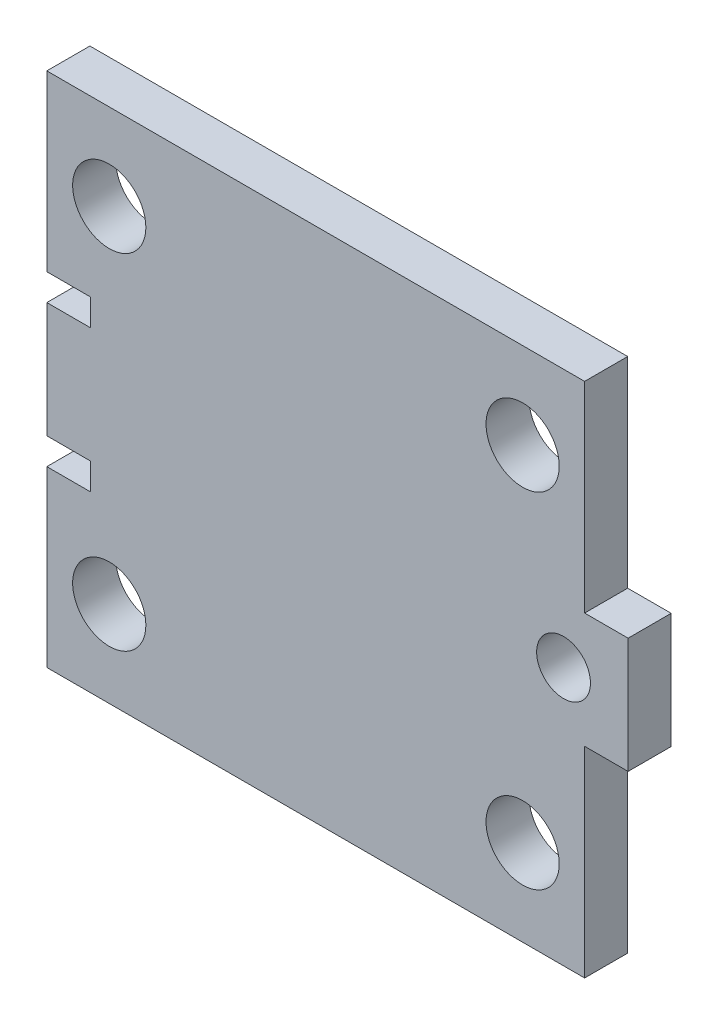
ISO-10303-21;
HEADER;
FILE_DESCRIPTION(('STEP AP214'),'2;1');
FILE_NAME('part.step','',(''),(''),'','','');
FILE_SCHEMA(('AUTOMOTIVE_DESIGN { 1 0 10303 214 1 1 1 1 }'));
ENDSEC;
DATA;
#1=APPLICATION_CONTEXT('core data for automotive mechanical design processes');
#2=APPLICATION_PROTOCOL_DEFINITION('international standard','automotive_design',2000,#1);
#3=PRODUCT_CONTEXT('',#1,'mechanical');
#4=PRODUCT('Part','Part','',(#3));
#5=PRODUCT_RELATED_PRODUCT_CATEGORY('part','',(#4));
#6=PRODUCT_DEFINITION_FORMATION('','',#4);
#7=PRODUCT_DEFINITION_CONTEXT('part definition',#1,'design');
#8=PRODUCT_DEFINITION('design','',#6,#7);
#9=PRODUCT_DEFINITION_SHAPE('','',#8);
#10=(LENGTH_UNIT() NAMED_UNIT(*) SI_UNIT(.MILLI.,.METRE.));
#11=(NAMED_UNIT(*) PLANE_ANGLE_UNIT() SI_UNIT($,.RADIAN.));
#12=(NAMED_UNIT(*) SI_UNIT($,.STERADIAN.) SOLID_ANGLE_UNIT());
#13=UNCERTAINTY_MEASURE_WITH_UNIT(LENGTH_MEASURE(1.E-05),#10,'distance_accuracy_value','');
#14=(GEOMETRIC_REPRESENTATION_CONTEXT(3) GLOBAL_UNCERTAINTY_ASSIGNED_CONTEXT((#13)) GLOBAL_UNIT_ASSIGNED_CONTEXT((#10,
#11,#12)) REPRESENTATION_CONTEXT('',''));
#15=CARTESIAN_POINT('',(0.,0.,0.));
#16=DIRECTION('',(0.,0.,1.));
#17=DIRECTION('',(1.,0.,0.));
#18=AXIS2_PLACEMENT_3D('',#15,#16,#17);
#19=CARTESIAN_POINT('',(-67.5,-60.,-5.));
#20=DIRECTION('',(1.,0.,0.));
#21=DIRECTION('',(0.,1.,0.));
#22=AXIS2_PLACEMENT_3D('',#19,#20,#21);
#23=PLANE('',#22);
#24=DIRECTION('',(0.,0.,-1.));
#25=VECTOR('',#24,1.);
#26=CARTESIAN_POINT('',(-67.5,-13.4,-5.));
#27=LINE('',#26,#25);
#28=CARTESIAN_POINT('',(-67.5,-13.4,5.));
#29=VERTEX_POINT('',#28);
#30=CARTESIAN_POINT('',(-67.5,-13.4,-5.));
#31=VERTEX_POINT('',#30);
#32=EDGE_CURVE('E11',#29,#31,#27,.T.);
#33=ORIENTED_EDGE('',*,*,#32,.F.);
#34=DIRECTION('',(0.,1.,0.));
#35=VECTOR('',#34,1.);
#36=CARTESIAN_POINT('',(-67.5,-60.,5.));
#37=LINE('',#36,#35);
#38=CARTESIAN_POINT('',(-67.5,13.4,5.));
#39=VERTEX_POINT('',#38);
#40=EDGE_CURVE('E132',#29,#39,#37,.T.);
#41=ORIENTED_EDGE('',*,*,#40,.T.);
#42=DIRECTION('',(0.,0.,-1.));
#43=VECTOR('',#42,1.);
#44=CARTESIAN_POINT('',(-67.5,13.4,-5.));
#45=LINE('',#44,#43);
#46=CARTESIAN_POINT('',(-67.5,13.4,-5.));
#47=VERTEX_POINT('',#46);
#48=EDGE_CURVE('E50',#39,#47,#45,.T.);
#49=ORIENTED_EDGE('',*,*,#48,.T.);
#50=DIRECTION('',(0.,1.,0.));
#51=VECTOR('',#50,1.);
#52=CARTESIAN_POINT('',(-67.5,-60.,-5.));
#53=LINE('',#52,#51);
#54=EDGE_CURVE('E256',#31,#47,#53,.T.);
#55=ORIENTED_EDGE('',*,*,#54,.F.);
#56=EDGE_LOOP('',(#33,#41,#49,#55));
#57=FACE_BOUND('',#56,.T.);
#58=ADVANCED_FACE('F39',(#57),#23,.F.);
#59=CARTESIAN_POINT('',(-67.5,13.4,-5.));
#60=DIRECTION('',(0.,-1.,0.));
#61=DIRECTION('',(1.,0.,0.));
#62=AXIS2_PLACEMENT_3D('',#59,#60,#61);
#63=PLANE('',#62);
#64=ORIENTED_EDGE('',*,*,#48,.F.);
#65=DIRECTION('',(1.,0.,0.));
#66=VECTOR('',#65,1.);
#67=CARTESIAN_POINT('',(67.5,13.4,5.));
#68=LINE('',#67,#66);
#69=CARTESIAN_POINT('',(-57.4,13.4,5.));
#70=VERTEX_POINT('',#69);
#71=EDGE_CURVE('E194',#39,#70,#68,.T.);
#72=ORIENTED_EDGE('',*,*,#71,.T.);
#73=DIRECTION('',(0.,0.,-1.));
#74=VECTOR('',#73,1.);
#75=CARTESIAN_POINT('',(-57.4,13.4,-5.));
#76=LINE('',#75,#74);
#77=CARTESIAN_POINT('',(-57.4,13.4,-5.));
#78=VERTEX_POINT('',#77);
#79=EDGE_CURVE('E245',#70,#78,#76,.T.);
#80=ORIENTED_EDGE('',*,*,#79,.T.);
#81=DIRECTION('',(1.,0.,0.));
#82=VECTOR('',#81,1.);
#83=CARTESIAN_POINT('',(-67.5,13.4,-5.));
#84=LINE('',#83,#82);
#85=EDGE_CURVE('E265',#47,#78,#84,.T.);
#86=ORIENTED_EDGE('',*,*,#85,.F.);
#87=EDGE_LOOP('',(#64,#72,#80,#86));
#88=FACE_BOUND('',#87,.T.);
#89=ADVANCED_FACE('F270',(#88),#63,.F.);
#90=CARTESIAN_POINT('',(-57.4,19.6,-5.));
#91=DIRECTION('',(1.,0.,0.));
#92=DIRECTION('',(0.,1.,0.));
#93=AXIS2_PLACEMENT_3D('',#90,#91,#92);
#94=PLANE('',#93);
#95=ORIENTED_EDGE('',*,*,#79,.F.);
#96=DIRECTION('',(0.,1.,0.));
#97=VECTOR('',#96,1.);
#98=CARTESIAN_POINT('',(-57.4,-60.,5.));
#99=LINE('',#98,#97);
#100=CARTESIAN_POINT('',(-57.4,19.6,5.));
#101=VERTEX_POINT('',#100);
#102=EDGE_CURVE('E190',#70,#101,#99,.T.);
#103=ORIENTED_EDGE('',*,*,#102,.T.);
#104=DIRECTION('',(0.,0.,-1.));
#105=VECTOR('',#104,1.);
#106=CARTESIAN_POINT('',(-57.4,19.6,-5.));
#107=LINE('',#106,#105);
#108=CARTESIAN_POINT('',(-57.4,19.6,-5.));
#109=VERTEX_POINT('',#108);
#110=EDGE_CURVE('E241',#101,#109,#107,.T.);
#111=ORIENTED_EDGE('',*,*,#110,.T.);
#112=DIRECTION('',(0.,1.,0.));
#113=VECTOR('',#112,1.);
#114=CARTESIAN_POINT('',(-57.4,19.6,-5.));
#115=LINE('',#114,#113);
#116=EDGE_CURVE('E272',#78,#109,#115,.T.);
#117=ORIENTED_EDGE('',*,*,#116,.F.);
#118=EDGE_LOOP('',(#95,#103,#111,#117));
#119=FACE_BOUND('',#118,.T.);
#120=ADVANCED_FACE('F359',(#119),#94,.F.);
#121=CARTESIAN_POINT('',(-67.5,19.6,-5.));
#122=DIRECTION('',(0.,1.,0.));
#123=DIRECTION('',(-1.,0.,0.));
#124=AXIS2_PLACEMENT_3D('',#121,#122,#123);
#125=PLANE('',#124);
#126=ORIENTED_EDGE('',*,*,#110,.F.);
#127=DIRECTION('',(1.,0.,0.));
#128=VECTOR('',#127,1.);
#129=CARTESIAN_POINT('',(67.5,19.6,5.));
#130=LINE('',#129,#128);
#131=CARTESIAN_POINT('',(-67.5,19.6,5.));
#132=VERTEX_POINT('',#131);
#133=EDGE_CURVE('E186',#101,#132,#130,.F.);
#134=ORIENTED_EDGE('',*,*,#133,.T.);
#135=DIRECTION('',(0.,0.,-1.));
#136=VECTOR('',#135,1.);
#137=CARTESIAN_POINT('',(-67.5,19.6,-5.));
#138=LINE('',#137,#136);
#139=CARTESIAN_POINT('',(-67.5,19.6,-5.));
#140=VERTEX_POINT('',#139);
#141=EDGE_CURVE('E237',#132,#140,#138,.T.);
#142=ORIENTED_EDGE('',*,*,#141,.T.);
#143=DIRECTION('',(-1.,0.,0.));
#144=VECTOR('',#143,1.);
#145=CARTESIAN_POINT('',(-67.5,19.6,-5.));
#146=LINE('',#145,#144);
#147=EDGE_CURVE('E276',#109,#140,#146,.T.);
#148=ORIENTED_EDGE('',*,*,#147,.F.);
#149=EDGE_LOOP('',(#126,#134,#142,#148));
#150=FACE_BOUND('',#149,.T.);
#151=ADVANCED_FACE('F364',(#150),#125,.F.);
#152=ORIENTED_EDGE('',*,*,#141,.F.);
#153=DIRECTION('',(0.,1.,0.));
#154=VECTOR('',#153,1.);
#155=CARTESIAN_POINT('',(-67.5,-60.,5.));
#156=LINE('',#155,#154);
#157=CARTESIAN_POINT('',(-67.5,60.,5.));
#158=VERTEX_POINT('',#157);
#159=EDGE_CURVE('E182',#132,#158,#156,.T.);
#160=ORIENTED_EDGE('',*,*,#159,.T.);
#161=DIRECTION('',(0.,0.,-1.));
#162=VECTOR('',#161,1.);
#163=CARTESIAN_POINT('',(-67.5,60.,-5.));
#164=LINE('',#163,#162);
#165=CARTESIAN_POINT('',(-67.5,60.,-5.));
#166=VERTEX_POINT('',#165);
#167=EDGE_CURVE('E233',#158,#166,#164,.T.);
#168=ORIENTED_EDGE('',*,*,#167,.T.);
#169=EDGE_CURVE('E269',#140,#166,#53,.T.);
#170=ORIENTED_EDGE('',*,*,#169,.F.);
#171=EDGE_LOOP('',(#152,#160,#168,#170));
#172=FACE_BOUND('',#171,.T.);
#173=ADVANCED_FACE('F354',(#172),#23,.F.);
#174=CARTESIAN_POINT('',(67.5,60.,-5.));
#175=DIRECTION('',(0.,1.,0.));
#176=DIRECTION('',(-1.,0.,0.));
#177=AXIS2_PLACEMENT_3D('',#174,#175,#176);
#178=PLANE('',#177);
#179=ORIENTED_EDGE('',*,*,#167,.F.);
#180=DIRECTION('',(1.,0.,0.));
#181=VECTOR('',#180,1.);
#182=CARTESIAN_POINT('',(67.5,60.,5.));
#183=LINE('',#182,#181);
#184=CARTESIAN_POINT('',(57.4,60.,5.));
#185=VERTEX_POINT('',#184);
#186=EDGE_CURVE('E178',#185,#158,#183,.F.);
#187=ORIENTED_EDGE('',*,*,#186,.F.);
#188=DIRECTION('',(0.,0.,-1.));
#189=VECTOR('',#188,1.);
#190=CARTESIAN_POINT('',(57.4,60.,-5.));
#191=LINE('',#190,#189);
#192=CARTESIAN_POINT('',(57.4,60.,-5.));
#193=VERTEX_POINT('',#192);
#194=EDGE_CURVE('E229',#185,#193,#191,.T.);
#195=ORIENTED_EDGE('',*,*,#194,.T.);
#196=DIRECTION('',(-1.,0.,0.));
#197=VECTOR('',#196,1.);
#198=CARTESIAN_POINT('',(67.5,60.,-5.));
#199=LINE('',#198,#197);
#200=EDGE_CURVE('E283',#193,#166,#199,.T.);
#201=ORIENTED_EDGE('',*,*,#200,.T.);
#202=EDGE_LOOP('',(#179,#187,#195,#201));
#203=FACE_BOUND('',#202,.T.);
#204=ADVANCED_FACE('F363',(#203),#178,.T.);
#205=CARTESIAN_POINT('',(57.4,19.6,-5.));
#206=DIRECTION('',(-1.,0.,0.));
#207=DIRECTION('',(0.,-1.,0.));
#208=AXIS2_PLACEMENT_3D('',#205,#206,#207);
#209=PLANE('',#208);
#210=ORIENTED_EDGE('',*,*,#194,.F.);
#211=DIRECTION('',(0.,1.,0.));
#212=VECTOR('',#211,1.);
#213=CARTESIAN_POINT('',(57.4,-60.,5.));
#214=LINE('',#213,#212);
#215=CARTESIAN_POINT('',(57.4,13.4,5.));
#216=VERTEX_POINT('',#215);
#217=EDGE_CURVE('E174',#185,#216,#214,.F.);
#218=ORIENTED_EDGE('',*,*,#217,.T.);
#219=DIRECTION('',(0.,0.,-1.));
#220=VECTOR('',#219,1.);
#221=CARTESIAN_POINT('',(57.4,13.4,-5.));
#222=LINE('',#221,#220);
#223=CARTESIAN_POINT('',(57.4,13.4,-5.));
#224=VERTEX_POINT('',#223);
#225=EDGE_CURVE('E225',#216,#224,#222,.T.);
#226=ORIENTED_EDGE('',*,*,#225,.T.);
#227=DIRECTION('',(0.,-1.,0.));
#228=VECTOR('',#227,1.);
#229=CARTESIAN_POINT('',(57.4,19.6,-5.));
#230=LINE('',#229,#228);
#231=EDGE_CURVE('E287',#193,#224,#230,.T.);
#232=ORIENTED_EDGE('',*,*,#231,.F.);
#233=EDGE_LOOP('',(#210,#218,#226,#232));
#234=FACE_BOUND('',#233,.T.);
#235=ADVANCED_FACE('F656',(#234),#209,.F.);
#236=CARTESIAN_POINT('',(67.5,13.4,-5.));
#237=DIRECTION('',(0.,-1.,0.));
#238=DIRECTION('',(1.,0.,0.));
#239=AXIS2_PLACEMENT_3D('',#236,#237,#238);
#240=PLANE('',#239);
#241=ORIENTED_EDGE('',*,*,#225,.F.);
#242=DIRECTION('',(1.,0.,0.));
#243=VECTOR('',#242,1.);
#244=CARTESIAN_POINT('',(67.5,13.4,5.));
#245=LINE('',#244,#243);
#246=CARTESIAN_POINT('',(67.5,13.4,5.));
#247=VERTEX_POINT('',#246);
#248=EDGE_CURVE('E170',#216,#247,#245,.T.);
#249=ORIENTED_EDGE('',*,*,#248,.T.);
#250=DIRECTION('',(0.,0.,-1.));
#251=VECTOR('',#250,1.);
#252=CARTESIAN_POINT('',(67.5,13.4,-5.));
#253=LINE('',#252,#251);
#254=CARTESIAN_POINT('',(67.5,13.4,-5.));
#255=VERTEX_POINT('',#254);
#256=EDGE_CURVE('E221',#247,#255,#253,.T.);
#257=ORIENTED_EDGE('',*,*,#256,.T.);
#258=DIRECTION('',(1.,0.,0.));
#259=VECTOR('',#258,1.);
#260=CARTESIAN_POINT('',(67.5,13.4,-5.));
#261=LINE('',#260,#259);
#262=EDGE_CURVE('E291',#224,#255,#261,.T.);
#263=ORIENTED_EDGE('',*,*,#262,.F.);
#264=EDGE_LOOP('',(#241,#249,#257,#263));
#265=FACE_BOUND('',#264,.T.);
#266=ADVANCED_FACE('F644',(#265),#240,.F.);
#267=CARTESIAN_POINT('',(67.5,-60.,-5.));
#268=DIRECTION('',(1.,0.,0.));
#269=DIRECTION('',(0.,1.,0.));
#270=AXIS2_PLACEMENT_3D('',#267,#268,#269);
#271=PLANE('',#270);
#272=ORIENTED_EDGE('',*,*,#256,.F.);
#273=DIRECTION('',(0.,1.,0.));
#274=VECTOR('',#273,1.);
#275=CARTESIAN_POINT('',(67.5,-60.,5.));
#276=LINE('',#275,#274);
#277=CARTESIAN_POINT('',(67.5,-13.4,5.));
#278=VERTEX_POINT('',#277);
#279=EDGE_CURVE('E166',#278,#247,#276,.T.);
#280=ORIENTED_EDGE('',*,*,#279,.F.);
#281=DIRECTION('',(0.,0.,-1.));
#282=VECTOR('',#281,1.);
#283=CARTESIAN_POINT('',(67.5,-13.4,-5.));
#284=LINE('',#283,#282);
#285=CARTESIAN_POINT('',(67.5,-13.4,-5.));
#286=VERTEX_POINT('',#285);
#287=EDGE_CURVE('E217',#278,#286,#284,.T.);
#288=ORIENTED_EDGE('',*,*,#287,.T.);
#289=DIRECTION('',(0.,1.,0.));
#290=VECTOR('',#289,1.);
#291=CARTESIAN_POINT('',(67.5,-60.,-5.));
#292=LINE('',#291,#290);
#293=EDGE_CURVE('E295',#286,#255,#292,.T.);
#294=ORIENTED_EDGE('',*,*,#293,.T.);
#295=EDGE_LOOP('',(#272,#280,#288,#294));
#296=FACE_BOUND('',#295,.T.);
#297=ADVANCED_FACE('F632',(#296),#271,.T.);
#298=CARTESIAN_POINT('',(67.5,-13.4,-5.));
#299=DIRECTION('',(0.,1.,0.));
#300=DIRECTION('',(-1.,0.,0.));
#301=AXIS2_PLACEMENT_3D('',#298,#299,#300);
#302=PLANE('',#301);
#303=ORIENTED_EDGE('',*,*,#287,.F.);
#304=DIRECTION('',(1.,0.,0.));
#305=VECTOR('',#304,1.);
#306=CARTESIAN_POINT('',(67.5,-13.4,5.));
#307=LINE('',#306,#305);
#308=CARTESIAN_POINT('',(57.4,-13.4,5.));
#309=VERTEX_POINT('',#308);
#310=EDGE_CURVE('E162',#278,#309,#307,.F.);
#311=ORIENTED_EDGE('',*,*,#310,.T.);
#312=DIRECTION('',(0.,0.,-1.));
#313=VECTOR('',#312,1.);
#314=CARTESIAN_POINT('',(57.4,-13.4,-5.));
#315=LINE('',#314,#313);
#316=CARTESIAN_POINT('',(57.4,-13.4,-5.));
#317=VERTEX_POINT('',#316);
#318=EDGE_CURVE('E213',#309,#317,#315,.T.);
#319=ORIENTED_EDGE('',*,*,#318,.T.);
#320=DIRECTION('',(-1.,0.,0.));
#321=VECTOR('',#320,1.);
#322=CARTESIAN_POINT('',(67.5,-13.4,-5.));
#323=LINE('',#322,#321);
#324=EDGE_CURVE('E299',#286,#317,#323,.T.);
#325=ORIENTED_EDGE('',*,*,#324,.F.);
#326=EDGE_LOOP('',(#303,#311,#319,#325));
#327=FACE_BOUND('',#326,.T.);
#328=ADVANCED_FACE('F392',(#327),#302,.F.);
#329=CARTESIAN_POINT('',(57.4,-19.6,-5.));
#330=DIRECTION('',(-1.,0.,0.));
#331=DIRECTION('',(0.,-1.,0.));
#332=AXIS2_PLACEMENT_3D('',#329,#330,#331);
#333=PLANE('',#332);
#334=ORIENTED_EDGE('',*,*,#318,.F.);
#335=DIRECTION('',(0.,1.,0.));
#336=VECTOR('',#335,1.);
#337=CARTESIAN_POINT('',(57.4,-60.,5.));
#338=LINE('',#337,#336);
#339=CARTESIAN_POINT('',(57.4,-60.,5.));
#340=VERTEX_POINT('',#339);
#341=EDGE_CURVE('E158',#309,#340,#338,.F.);
#342=ORIENTED_EDGE('',*,*,#341,.T.);
#343=DIRECTION('',(0.,0.,-1.));
#344=VECTOR('',#343,1.);
#345=CARTESIAN_POINT('',(57.4,-60.,-5.));
#346=LINE('',#345,#344);
#347=CARTESIAN_POINT('',(57.4,-60.,-5.));
#348=VERTEX_POINT('',#347);
#349=EDGE_CURVE('E209',#340,#348,#346,.T.);
#350=ORIENTED_EDGE('',*,*,#349,.T.);
#351=DIRECTION('',(0.,-1.,0.));
#352=VECTOR('',#351,1.);
#353=CARTESIAN_POINT('',(57.4,-19.6,-5.));
#354=LINE('',#353,#352);
#355=EDGE_CURVE('E303',#317,#348,#354,.T.);
#356=ORIENTED_EDGE('',*,*,#355,.F.);
#357=EDGE_LOOP('',(#334,#342,#350,#356));
#358=FACE_BOUND('',#357,.T.);
#359=ADVANCED_FACE('F374',(#358),#333,.F.);
#360=CARTESIAN_POINT('',(67.5,-60.,-5.));
#361=DIRECTION('',(0.,1.,0.));
#362=DIRECTION('',(-1.,0.,0.));
#363=AXIS2_PLACEMENT_3D('',#360,#361,#362);
#364=PLANE('',#363);
#365=ORIENTED_EDGE('',*,*,#349,.F.);
#366=DIRECTION('',(1.,0.,0.));
#367=VECTOR('',#366,1.);
#368=CARTESIAN_POINT('',(67.5,-60.,5.));
#369=LINE('',#368,#367);
#370=CARTESIAN_POINT('',(-67.5,-60.,5.));
#371=VERTEX_POINT('',#370);
#372=EDGE_CURVE('E154',#340,#371,#369,.F.);
#373=ORIENTED_EDGE('',*,*,#372,.T.);
#374=DIRECTION('',(0.,0.,-1.));
#375=VECTOR('',#374,1.);
#376=CARTESIAN_POINT('',(-67.5,-60.,-5.));
#377=LINE('',#376,#375);
#378=CARTESIAN_POINT('',(-67.5,-60.,-5.));
#379=VERTEX_POINT('',#378);
#380=EDGE_CURVE('E205',#371,#379,#377,.T.);
#381=ORIENTED_EDGE('',*,*,#380,.T.);
#382=DIRECTION('',(-1.,0.,0.));
#383=VECTOR('',#382,1.);
#384=CARTESIAN_POINT('',(67.5,-60.,-5.));
#385=LINE('',#384,#383);
#386=EDGE_CURVE('E307',#348,#379,#385,.T.);
#387=ORIENTED_EDGE('',*,*,#386,.F.);
#388=EDGE_LOOP('',(#365,#373,#381,#387));
#389=FACE_BOUND('',#388,.T.);
#390=ADVANCED_FACE('F368',(#389),#364,.F.);
#391=ORIENTED_EDGE('',*,*,#380,.F.);
#392=DIRECTION('',(0.,1.,0.));
#393=VECTOR('',#392,1.);
#394=CARTESIAN_POINT('',(-67.5,-60.,5.));
#395=LINE('',#394,#393);
#396=CARTESIAN_POINT('',(-67.5,-19.6,5.));
#397=VERTEX_POINT('',#396);
#398=EDGE_CURVE('E150',#371,#397,#395,.T.);
#399=ORIENTED_EDGE('',*,*,#398,.T.);
#400=DIRECTION('',(0.,0.,-1.));
#401=VECTOR('',#400,1.);
#402=CARTESIAN_POINT('',(-67.5,-19.6,-5.));
#403=LINE('',#402,#401);
#404=CARTESIAN_POINT('',(-67.5,-19.6,-5.));
#405=VERTEX_POINT('',#404);
#406=EDGE_CURVE('E202',#397,#405,#403,.T.);
#407=ORIENTED_EDGE('',*,*,#406,.T.);
#408=EDGE_CURVE('E268',#379,#405,#53,.T.);
#409=ORIENTED_EDGE('',*,*,#408,.F.);
#410=EDGE_LOOP('',(#391,#399,#407,#409));
#411=FACE_BOUND('',#410,.T.);
#412=ADVANCED_FACE('F355',(#411),#23,.F.);
#413=CARTESIAN_POINT('',(-67.5,-19.6,-5.));
#414=DIRECTION('',(0.,-1.,0.));
#415=DIRECTION('',(1.,0.,0.));
#416=AXIS2_PLACEMENT_3D('',#413,#414,#415);
#417=PLANE('',#416);
#418=ORIENTED_EDGE('',*,*,#406,.F.);
#419=DIRECTION('',(1.,0.,0.));
#420=VECTOR('',#419,1.);
#421=CARTESIAN_POINT('',(67.5,-19.6,5.));
#422=LINE('',#421,#420);
#423=CARTESIAN_POINT('',(-57.4,-19.6,5.));
#424=VERTEX_POINT('',#423);
#425=EDGE_CURVE('E146',#397,#424,#422,.T.);
#426=ORIENTED_EDGE('',*,*,#425,.T.);
#427=DIRECTION('',(0.,0.,-1.));
#428=VECTOR('',#427,1.);
#429=CARTESIAN_POINT('',(-57.4,-19.6,-5.));
#430=LINE('',#429,#428);
#431=CARTESIAN_POINT('',(-57.4,-19.6,-5.));
#432=VERTEX_POINT('',#431);
#433=EDGE_CURVE('E58',#424,#432,#430,.T.);
#434=ORIENTED_EDGE('',*,*,#433,.T.);
#435=DIRECTION('',(1.,0.,0.));
#436=VECTOR('',#435,1.);
#437=CARTESIAN_POINT('',(-67.5,-19.6,-5.));
#438=LINE('',#437,#436);
#439=EDGE_CURVE('E125',#405,#432,#438,.T.);
#440=ORIENTED_EDGE('',*,*,#439,.F.);
#441=EDGE_LOOP('',(#418,#426,#434,#440));
#442=FACE_BOUND('',#441,.T.);
#443=ADVANCED_FACE('F367',(#442),#417,.F.);
#444=CARTESIAN_POINT('',(-57.4,-19.6,-5.));
#445=DIRECTION('',(1.,0.,0.));
#446=DIRECTION('',(0.,1.,0.));
#447=AXIS2_PLACEMENT_3D('',#444,#445,#446);
#448=PLANE('',#447);
#449=ORIENTED_EDGE('',*,*,#433,.F.);
#450=DIRECTION('',(0.,1.,0.));
#451=VECTOR('',#450,1.);
#452=CARTESIAN_POINT('',(-57.4,-60.,5.));
#453=LINE('',#452,#451);
#454=CARTESIAN_POINT('',(-57.4,-13.4,5.));
#455=VERTEX_POINT('',#454);
#456=EDGE_CURVE('E130',#424,#455,#453,.T.);
#457=ORIENTED_EDGE('',*,*,#456,.T.);
#458=DIRECTION('',(0.,0.,-1.));
#459=VECTOR('',#458,1.);
#460=CARTESIAN_POINT('',(-57.4,-13.4,-5.));
#461=LINE('',#460,#459);
#462=CARTESIAN_POINT('',(-57.4,-13.4,-5.));
#463=VERTEX_POINT('',#462);
#464=EDGE_CURVE('E43',#455,#463,#461,.T.);
#465=ORIENTED_EDGE('',*,*,#464,.T.);
#466=DIRECTION('',(0.,1.,0.));
#467=VECTOR('',#466,1.);
#468=CARTESIAN_POINT('',(-57.4,-19.6,-5.));
#469=LINE('',#468,#467);
#470=EDGE_CURVE('E430',#432,#463,#469,.T.);
#471=ORIENTED_EDGE('',*,*,#470,.F.);
#472=EDGE_LOOP('',(#449,#457,#465,#471));
#473=FACE_BOUND('',#472,.T.);
#474=ADVANCED_FACE('F135',(#473),#448,.F.);
#475=CARTESIAN_POINT('',(52.5,0.,-5.));
#476=DIRECTION('',(0.,0.,1.));
#477=DIRECTION('',(1.,0.,0.));
#478=AXIS2_PLACEMENT_3D('',#475,#476,#477);
#479=CYLINDRICAL_SURFACE('',#478,6.25);
#480=CARTESIAN_POINT('',(52.5,0.,-5.));
#481=DIRECTION('',(0.,0.,1.));
#482=DIRECTION('',(1.,0.,0.));
#483=AXIS2_PLACEMENT_3D('',#480,#481,#482);
#484=CIRCLE('',#483,6.25);
#485=CARTESIAN_POINT('',(58.75,0.,-5.));
#486=VERTEX_POINT('',#485);
#487=EDGE_CURVE('E149',#486,#486,#484,.T.);
#488=ORIENTED_EDGE('',*,*,#487,.F.);
#489=EDGE_LOOP('',(#488));
#490=FACE_BOUND('',#489,.T.);
#491=CARTESIAN_POINT('',(52.5,0.,5.));
#492=DIRECTION('',(0.,0.,1.));
#493=DIRECTION('',(1.,0.,0.));
#494=AXIS2_PLACEMENT_3D('',#491,#492,#493);
#495=CIRCLE('',#494,6.25);
#496=CARTESIAN_POINT('',(58.75,0.,5.));
#497=VERTEX_POINT('',#496);
#498=EDGE_CURVE('E314',#497,#497,#495,.T.);
#499=ORIENTED_EDGE('',*,*,#498,.T.);
#500=EDGE_LOOP('',(#499));
#501=FACE_BOUND('',#500,.T.);
#502=ADVANCED_FACE('F458',(#490,#501),#479,.F.);
#503=CARTESIAN_POINT('',(-53.,40.,-5.));
#504=DIRECTION('',(0.,0.,1.));
#505=DIRECTION('',(1.,0.,0.));
#506=AXIS2_PLACEMENT_3D('',#503,#504,#505);
#507=CYLINDRICAL_SURFACE('',#506,8.49999999999999);
#508=CARTESIAN_POINT('',(-53.,40.,-5.));
#509=DIRECTION('',(0.,0.,1.));
#510=DIRECTION('',(1.,0.,0.));
#511=AXIS2_PLACEMENT_3D('',#508,#509,#510);
#512=CIRCLE('',#511,8.49999999999999);
#513=CARTESIAN_POINT('',(-44.5,40.,-5.));
#514=VERTEX_POINT('',#513);
#515=EDGE_CURVE('E447',#514,#514,#512,.T.);
#516=ORIENTED_EDGE('',*,*,#515,.F.);
#517=EDGE_LOOP('',(#516));
#518=FACE_BOUND('',#517,.T.);
#519=CARTESIAN_POINT('',(-53.,40.,5.));
#520=DIRECTION('',(0.,0.,1.));
#521=DIRECTION('',(1.,0.,0.));
#522=AXIS2_PLACEMENT_3D('',#519,#520,#521);
#523=CIRCLE('',#522,8.49999999999999);
#524=CARTESIAN_POINT('',(-44.5,40.,5.));
#525=VERTEX_POINT('',#524);
#526=EDGE_CURVE('E318',#525,#525,#523,.T.);
#527=ORIENTED_EDGE('',*,*,#526,.T.);
#528=EDGE_LOOP('',(#527));
#529=FACE_BOUND('',#528,.T.);
#530=ADVANCED_FACE('F461',(#518,#529),#507,.F.);
#531=CARTESIAN_POINT('',(43.,40.,-5.));
#532=DIRECTION('',(0.,0.,1.));
#533=DIRECTION('',(1.,0.,0.));
#534=AXIS2_PLACEMENT_3D('',#531,#532,#533);
#535=CYLINDRICAL_SURFACE('',#534,8.49999999999999);
#536=CARTESIAN_POINT('',(43.,40.,-5.));
#537=DIRECTION('',(0.,0.,1.));
#538=DIRECTION('',(1.,0.,0.));
#539=AXIS2_PLACEMENT_3D('',#536,#537,#538);
#540=CIRCLE('',#539,8.49999999999999);
#541=CARTESIAN_POINT('',(51.5,40.,-5.));
#542=VERTEX_POINT('',#541);
#543=EDGE_CURVE('E443',#542,#542,#540,.T.);
#544=ORIENTED_EDGE('',*,*,#543,.F.);
#545=EDGE_LOOP('',(#544));
#546=FACE_BOUND('',#545,.T.);
#547=CARTESIAN_POINT('',(43.,40.,5.));
#548=DIRECTION('',(0.,0.,1.));
#549=DIRECTION('',(1.,0.,0.));
#550=AXIS2_PLACEMENT_3D('',#547,#548,#549);
#551=CIRCLE('',#550,8.49999999999999);
#552=CARTESIAN_POINT('',(51.5,40.,5.));
#553=VERTEX_POINT('',#552);
#554=EDGE_CURVE('E322',#553,#553,#551,.T.);
#555=ORIENTED_EDGE('',*,*,#554,.T.);
#556=EDGE_LOOP('',(#555));
#557=FACE_BOUND('',#556,.T.);
#558=ADVANCED_FACE('F347',(#546,#557),#535,.F.);
#559=CARTESIAN_POINT('',(43.,-40.,-5.));
#560=DIRECTION('',(0.,0.,1.));
#561=DIRECTION('',(1.,0.,0.));
#562=AXIS2_PLACEMENT_3D('',#559,#560,#561);
#563=CYLINDRICAL_SURFACE('',#562,8.5);
#564=CARTESIAN_POINT('',(43.,-40.,-5.));
#565=DIRECTION('',(0.,0.,1.));
#566=DIRECTION('',(1.,0.,0.));
#567=AXIS2_PLACEMENT_3D('',#564,#565,#566);
#568=CIRCLE('',#567,8.5);
#569=CARTESIAN_POINT('',(51.5,-40.,-5.));
#570=VERTEX_POINT('',#569);
#571=EDGE_CURVE('E437',#570,#570,#568,.T.);
#572=ORIENTED_EDGE('',*,*,#571,.F.);
#573=EDGE_LOOP('',(#572));
#574=FACE_BOUND('',#573,.T.);
#575=CARTESIAN_POINT('',(43.,-40.,5.));
#576=DIRECTION('',(0.,0.,1.));
#577=DIRECTION('',(1.,0.,0.));
#578=AXIS2_PLACEMENT_3D('',#575,#576,#577);
#579=CIRCLE('',#578,8.5);
#580=CARTESIAN_POINT('',(51.5,-40.,5.));
#581=VERTEX_POINT('',#580);
#582=EDGE_CURVE('E142',#581,#581,#579,.T.);
#583=ORIENTED_EDGE('',*,*,#582,.T.);
#584=EDGE_LOOP('',(#583));
#585=FACE_BOUND('',#584,.T.);
#586=ADVANCED_FACE('F331',(#574,#585),#563,.F.);
#587=CARTESIAN_POINT('',(-53.,-40.,-5.));
#588=DIRECTION('',(0.,0.,1.));
#589=DIRECTION('',(1.,0.,0.));
#590=AXIS2_PLACEMENT_3D('',#587,#588,#589);
#591=CYLINDRICAL_SURFACE('',#590,8.5);
#592=CARTESIAN_POINT('',(-53.,-40.,-5.));
#593=DIRECTION('',(0.,0.,1.));
#594=DIRECTION('',(1.,0.,0.));
#595=AXIS2_PLACEMENT_3D('',#592,#593,#594);
#596=CIRCLE('',#595,8.5);
#597=CARTESIAN_POINT('',(-44.5,-40.,-5.));
#598=VERTEX_POINT('',#597);
#599=EDGE_CURVE('E431',#598,#598,#596,.T.);
#600=ORIENTED_EDGE('',*,*,#599,.F.);
#601=EDGE_LOOP('',(#600));
#602=FACE_BOUND('',#601,.T.);
#603=CARTESIAN_POINT('',(-53.,-40.,5.));
#604=DIRECTION('',(0.,0.,1.));
#605=DIRECTION('',(1.,0.,0.));
#606=AXIS2_PLACEMENT_3D('',#603,#604,#605);
#607=CIRCLE('',#606,8.5);
#608=CARTESIAN_POINT('',(-44.5,-40.,5.));
#609=VERTEX_POINT('',#608);
#610=EDGE_CURVE('E137',#609,#609,#607,.T.);
#611=ORIENTED_EDGE('',*,*,#610,.T.);
#612=EDGE_LOOP('',(#611));
#613=FACE_BOUND('',#612,.T.);
#614=ADVANCED_FACE('F339',(#602,#613),#591,.F.);
#615=CARTESIAN_POINT('',(-67.5,-13.4,-5.));
#616=DIRECTION('',(0.,1.,0.));
#617=DIRECTION('',(-1.,0.,0.));
#618=AXIS2_PLACEMENT_3D('',#615,#616,#617);
#619=PLANE('',#618);
#620=DIRECTION('',(1.,0.,0.));
#621=VECTOR('',#620,1.);
#622=CARTESIAN_POINT('',(67.5,-13.4,5.));
#623=LINE('',#622,#621);
#624=EDGE_CURVE('E118',#455,#29,#623,.F.);
#625=ORIENTED_EDGE('',*,*,#624,.T.);
#626=ORIENTED_EDGE('',*,*,#32,.T.);
#627=DIRECTION('',(-1.,0.,0.));
#628=VECTOR('',#627,1.);
#629=CARTESIAN_POINT('',(-67.5,-13.4,-5.));
#630=LINE('',#629,#628);
#631=EDGE_CURVE('E120',#463,#31,#630,.T.);
#632=ORIENTED_EDGE('',*,*,#631,.F.);
#633=ORIENTED_EDGE('',*,*,#464,.F.);
#634=EDGE_LOOP('',(#625,#626,#632,#633));
#635=FACE_BOUND('',#634,.T.);
#636=ADVANCED_FACE('F41',(#635),#619,.F.);
#637=CARTESIAN_POINT('',(67.5,-60.,-5.));
#638=DIRECTION('',(0.,0.,1.));
#639=DIRECTION('',(1.,0.,0.));
#640=AXIS2_PLACEMENT_3D('',#637,#638,#639);
#641=PLANE('',#640);
#642=ORIENTED_EDGE('',*,*,#487,.T.);
#643=EDGE_LOOP('',(#642));
#644=FACE_BOUND('',#643,.T.);
#645=ORIENTED_EDGE('',*,*,#515,.T.);
#646=EDGE_LOOP('',(#645));
#647=FACE_BOUND('',#646,.T.);
#648=ORIENTED_EDGE('',*,*,#543,.T.);
#649=EDGE_LOOP('',(#648));
#650=FACE_BOUND('',#649,.T.);
#651=ORIENTED_EDGE('',*,*,#571,.T.);
#652=EDGE_LOOP('',(#651));
#653=FACE_BOUND('',#652,.T.);
#654=ORIENTED_EDGE('',*,*,#599,.T.);
#655=EDGE_LOOP('',(#654));
#656=FACE_BOUND('',#655,.T.);
#657=ORIENTED_EDGE('',*,*,#470,.T.);
#658=ORIENTED_EDGE('',*,*,#631,.T.);
#659=ORIENTED_EDGE('',*,*,#54,.T.);
#660=ORIENTED_EDGE('',*,*,#85,.T.);
#661=ORIENTED_EDGE('',*,*,#116,.T.);
#662=ORIENTED_EDGE('',*,*,#147,.T.);
#663=ORIENTED_EDGE('',*,*,#169,.T.);
#664=ORIENTED_EDGE('',*,*,#200,.F.);
#665=ORIENTED_EDGE('',*,*,#231,.T.);
#666=ORIENTED_EDGE('',*,*,#262,.T.);
#667=ORIENTED_EDGE('',*,*,#293,.F.);
#668=ORIENTED_EDGE('',*,*,#324,.T.);
#669=ORIENTED_EDGE('',*,*,#355,.T.);
#670=ORIENTED_EDGE('',*,*,#386,.T.);
#671=ORIENTED_EDGE('',*,*,#408,.T.);
#672=ORIENTED_EDGE('',*,*,#439,.T.);
#673=EDGE_LOOP('',(#657,#658,#659,#660,#661,#662,#663,#664,#665,#666,#667,#668,#669,#670,#671,#672));
#674=FACE_BOUND('',#673,.T.);
#675=ADVANCED_FACE('F263',(#644,#647,#650,#653,#656,#674),#641,.F.);
#676=CARTESIAN_POINT('',(67.5,-60.,5.));
#677=DIRECTION('',(0.,0.,1.));
#678=DIRECTION('',(1.,0.,0.));
#679=AXIS2_PLACEMENT_3D('',#676,#677,#678);
#680=PLANE('',#679);
#681=ORIENTED_EDGE('',*,*,#498,.F.);
#682=EDGE_LOOP('',(#681));
#683=FACE_BOUND('',#682,.T.);
#684=ORIENTED_EDGE('',*,*,#526,.F.);
#685=EDGE_LOOP('',(#684));
#686=FACE_BOUND('',#685,.T.);
#687=ORIENTED_EDGE('',*,*,#554,.F.);
#688=EDGE_LOOP('',(#687));
#689=FACE_BOUND('',#688,.T.);
#690=ORIENTED_EDGE('',*,*,#582,.F.);
#691=EDGE_LOOP('',(#690));
#692=FACE_BOUND('',#691,.T.);
#693=ORIENTED_EDGE('',*,*,#610,.F.);
#694=EDGE_LOOP('',(#693));
#695=FACE_BOUND('',#694,.T.);
#696=ORIENTED_EDGE('',*,*,#456,.F.);
#697=ORIENTED_EDGE('',*,*,#425,.F.);
#698=ORIENTED_EDGE('',*,*,#398,.F.);
#699=ORIENTED_EDGE('',*,*,#372,.F.);
#700=ORIENTED_EDGE('',*,*,#341,.F.);
#701=ORIENTED_EDGE('',*,*,#310,.F.);
#702=ORIENTED_EDGE('',*,*,#279,.T.);
#703=ORIENTED_EDGE('',*,*,#248,.F.);
#704=ORIENTED_EDGE('',*,*,#217,.F.);
#705=ORIENTED_EDGE('',*,*,#186,.T.);
#706=ORIENTED_EDGE('',*,*,#159,.F.);
#707=ORIENTED_EDGE('',*,*,#133,.F.);
#708=ORIENTED_EDGE('',*,*,#102,.F.);
#709=ORIENTED_EDGE('',*,*,#71,.F.);
#710=ORIENTED_EDGE('',*,*,#40,.F.);
#711=ORIENTED_EDGE('',*,*,#624,.F.);
#712=EDGE_LOOP('',(#696,#697,#698,#699,#700,#701,#702,#703,#704,#705,#706,#707,#708,#709,#710,#711));
#713=FACE_BOUND('',#712,.T.);
#714=ADVANCED_FACE('F128',(#683,#686,#689,#692,#695,#713),#680,.T.);
#715=CLOSED_SHELL('',(#58,#89,#120,#151,#173,#204,#235,#266,#297,#328,#359,#390,#412,#443,#474,
#502,#530,#558,#586,#614,#636,#675,#714));
#716=MANIFOLD_SOLID_BREP('B2',#715);
#717=ADVANCED_BREP_SHAPE_REPRESENTATION('',(#18,#716),#14);
#718=SHAPE_DEFINITION_REPRESENTATION(#9,#717);
ENDSEC;
END-ISO-10303-21;
